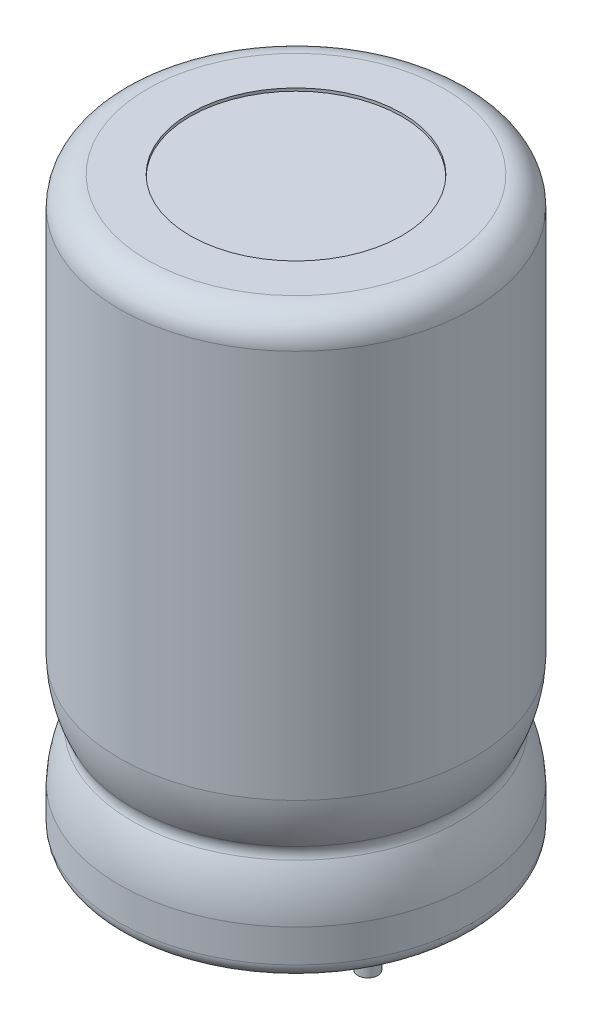
ISO-10303-21;
HEADER;
FILE_DESCRIPTION(('STEP AP214'),'2;1');
FILE_NAME('part.step','',(''),(''),'','','');
FILE_SCHEMA(('AUTOMOTIVE_DESIGN { 1 0 10303 214 1 1 1 1 }'));
ENDSEC;
DATA;
#1=APPLICATION_CONTEXT('core data for automotive mechanical design processes');
#2=APPLICATION_PROTOCOL_DEFINITION('international standard','automotive_design',2000,#1);
#3=PRODUCT_CONTEXT('',#1,'mechanical');
#4=PRODUCT('Part','Part','',(#3));
#5=PRODUCT_RELATED_PRODUCT_CATEGORY('part','',(#4));
#6=PRODUCT_DEFINITION_FORMATION('','',#4);
#7=PRODUCT_DEFINITION_CONTEXT('part definition',#1,'design');
#8=PRODUCT_DEFINITION('design','',#6,#7);
#9=PRODUCT_DEFINITION_SHAPE('','',#8);
#10=(LENGTH_UNIT() NAMED_UNIT(*) SI_UNIT(.MILLI.,.METRE.));
#11=(NAMED_UNIT(*) PLANE_ANGLE_UNIT() SI_UNIT($,.RADIAN.));
#12=(NAMED_UNIT(*) SI_UNIT($,.STERADIAN.) SOLID_ANGLE_UNIT());
#13=UNCERTAINTY_MEASURE_WITH_UNIT(LENGTH_MEASURE(1.E-05),#10,'distance_accuracy_value','');
#14=(GEOMETRIC_REPRESENTATION_CONTEXT(3) GLOBAL_UNCERTAINTY_ASSIGNED_CONTEXT((#13)) GLOBAL_UNIT_ASSIGNED_CONTEXT((#10,
#11,#12)) REPRESENTATION_CONTEXT('',''));
#15=CARTESIAN_POINT('',(0.,0.,0.));
#16=DIRECTION('',(0.,0.,1.));
#17=DIRECTION('',(1.,0.,0.));
#18=AXIS2_PLACEMENT_3D('',#15,#16,#17);
#19=CARTESIAN_POINT('',(-2.54,-0.2,0.));
#20=DIRECTION('',(0.,-1.,0.));
#21=DIRECTION('',(0.,0.,-1.));
#22=AXIS2_PLACEMENT_3D('',#19,#20,#21);
#23=PLANE('',#22);
#24=CARTESIAN_POINT('',(-2.54,-0.2,0.));
#25=DIRECTION('',(0.,-1.,0.));
#26=DIRECTION('',(0.,0.,-1.));
#27=AXIS2_PLACEMENT_3D('',#24,#25,#26);
#28=CIRCLE('',#27,5.75);
#29=CARTESIAN_POINT('',(-2.54,-0.2,-5.75));
#30=VERTEX_POINT('',#29);
#31=EDGE_CURVE('E83',#30,#30,#28,.T.);
#32=ORIENTED_EDGE('',*,*,#31,.T.);
#33=EDGE_LOOP('',(#32));
#34=FACE_BOUND('',#33,.T.);
#35=CARTESIAN_POINT('',(-2.54,-0.2,0.));
#36=DIRECTION('',(0.,-1.,0.));
#37=DIRECTION('',(0.,0.,-1.));
#38=AXIS2_PLACEMENT_3D('',#35,#36,#37);
#39=CIRCLE('',#38,3.75);
#40=CARTESIAN_POINT('',(-2.54,-0.2,-3.75));
#41=VERTEX_POINT('',#40);
#42=EDGE_CURVE('E71',#41,#41,#39,.T.);
#43=ORIENTED_EDGE('',*,*,#42,.F.);
#44=EDGE_LOOP('',(#43));
#45=FACE_BOUND('',#44,.T.);
#46=ADVANCED_FACE('F29',(#34,#45),#23,.T.);
#47=CARTESIAN_POINT('',(-2.54,-0.2,0.));
#48=DIRECTION('',(0.,1.,0.));
#49=DIRECTION('',(0.,0.,1.));
#50=AXIS2_PLACEMENT_3D('',#47,#48,#49);
#51=CYLINDRICAL_SURFACE('',#50,6.25);
#52=CARTESIAN_POINT('',(-2.54,1.45962740384602,0.));
#53=DIRECTION('',(0.,-1.,0.));
#54=DIRECTION('',(0.,0.,-1.));
#55=AXIS2_PLACEMENT_3D('',#52,#53,#54);
#56=CIRCLE('',#55,6.25);
#57=CARTESIAN_POINT('',(-2.54,1.45962740384602,-6.25));
#58=VERTEX_POINT('',#57);
#59=EDGE_CURVE('E45',#58,#58,#56,.T.);
#60=ORIENTED_EDGE('',*,*,#59,.T.);
#61=EDGE_LOOP('',(#60));
#62=FACE_BOUND('',#61,.T.);
#63=CARTESIAN_POINT('',(-2.54,0.3,0.));
#64=DIRECTION('',(0.,-1.,0.));
#65=DIRECTION('',(0.,0.,-1.));
#66=AXIS2_PLACEMENT_3D('',#63,#64,#65);
#67=CIRCLE('',#66,6.25);
#68=CARTESIAN_POINT('',(-2.54,0.3,-6.25));
#69=VERTEX_POINT('',#68);
#70=EDGE_CURVE('E42',#69,#69,#67,.F.);
#71=ORIENTED_EDGE('',*,*,#70,.T.);
#72=EDGE_LOOP('',(#71));
#73=FACE_BOUND('',#72,.T.);
#74=ADVANCED_FACE('F88',(#62,#73),#51,.T.);
#75=CARTESIAN_POINT('',(-2.54,-0.1,0.));
#76=DIRECTION('',(0.,-1.,0.));
#77=DIRECTION('',(0.,0.,-1.));
#78=AXIS2_PLACEMENT_3D('',#75,#76,#77);
#79=CYLINDRICAL_SURFACE('',#78,3.75);
#80=CARTESIAN_POINT('',(-2.54,-0.1,0.));
#81=DIRECTION('',(0.,-1.,0.));
#82=DIRECTION('',(0.,0.,-1.));
#83=AXIS2_PLACEMENT_3D('',#80,#81,#82);
#84=CIRCLE('',#83,3.75);
#85=CARTESIAN_POINT('',(-2.54,-0.1,-3.75));
#86=VERTEX_POINT('',#85);
#87=EDGE_CURVE('E72',#86,#86,#84,.T.);
#88=ORIENTED_EDGE('',*,*,#87,.F.);
#89=EDGE_LOOP('',(#88));
#90=FACE_BOUND('',#89,.T.);
#91=ORIENTED_EDGE('',*,*,#42,.T.);
#92=EDGE_LOOP('',(#91));
#93=FACE_BOUND('',#92,.T.);
#94=ADVANCED_FACE('F102',(#90,#93),#79,.F.);
#95=CARTESIAN_POINT('',(-2.54,-0.1,0.));
#96=DIRECTION('',(0.,-1.,0.));
#97=DIRECTION('',(0.,0.,-1.));
#98=AXIS2_PLACEMENT_3D('',#95,#96,#97);
#99=PLANE('',#98);
#100=CARTESIAN_POINT('',(0.,-0.1,0.));
#101=DIRECTION('',(0.,-1.,0.));
#102=DIRECTION('',(0.,0.,-1.));
#103=AXIS2_PLACEMENT_3D('',#100,#101,#102);
#104=CIRCLE('',#103,0.35);
#105=CARTESIAN_POINT('',(0.,-0.1,-0.35));
#106=VERTEX_POINT('',#105);
#107=EDGE_CURVE('E63',#106,#106,#104,.T.);
#108=ORIENTED_EDGE('',*,*,#107,.F.);
#109=EDGE_LOOP('',(#108));
#110=FACE_BOUND('',#109,.T.);
#111=CARTESIAN_POINT('',(-5.08,-0.1,0.));
#112=DIRECTION('',(0.,-1.,0.));
#113=DIRECTION('',(0.,0.,-1.));
#114=AXIS2_PLACEMENT_3D('',#111,#112,#113);
#115=CIRCLE('',#114,0.35);
#116=CARTESIAN_POINT('',(-5.08,-0.1,-0.35));
#117=VERTEX_POINT('',#116);
#118=EDGE_CURVE('E68',#117,#117,#115,.T.);
#119=ORIENTED_EDGE('',*,*,#118,.F.);
#120=EDGE_LOOP('',(#119));
#121=FACE_BOUND('',#120,.T.);
#122=ORIENTED_EDGE('',*,*,#87,.T.);
#123=EDGE_LOOP('',(#122));
#124=FACE_BOUND('',#123,.T.);
#125=ADVANCED_FACE('F104',(#110,#121,#124),#99,.T.);
#126=CARTESIAN_POINT('',(-5.08,-3.,0.));
#127=DIRECTION('',(0.,-1.,0.));
#128=DIRECTION('',(0.,0.,-1.));
#129=AXIS2_PLACEMENT_3D('',#126,#127,#128);
#130=PLANE('',#129);
#131=CARTESIAN_POINT('',(-5.08,-3.,0.));
#132=DIRECTION('',(0.,-1.,0.));
#133=DIRECTION('',(0.,0.,-1.));
#134=AXIS2_PLACEMENT_3D('',#131,#132,#133);
#135=CIRCLE('',#134,0.35);
#136=CARTESIAN_POINT('',(-5.08,-3.,-0.35));
#137=VERTEX_POINT('',#136);
#138=EDGE_CURVE('E75',#137,#137,#135,.T.);
#139=ORIENTED_EDGE('',*,*,#138,.T.);
#140=EDGE_LOOP('',(#139));
#141=FACE_BOUND('',#140,.T.);
#142=ADVANCED_FACE('F111',(#141),#130,.T.);
#143=CARTESIAN_POINT('',(-5.08,-3.,0.));
#144=DIRECTION('',(0.,1.,0.));
#145=DIRECTION('',(0.,0.,1.));
#146=AXIS2_PLACEMENT_3D('',#143,#144,#145);
#147=CYLINDRICAL_SURFACE('',#146,0.35);
#148=ORIENTED_EDGE('',*,*,#138,.F.);
#149=EDGE_LOOP('',(#148));
#150=FACE_BOUND('',#149,.T.);
#151=ORIENTED_EDGE('',*,*,#118,.T.);
#152=EDGE_LOOP('',(#151));
#153=FACE_BOUND('',#152,.T.);
#154=ADVANCED_FACE('F126',(#150,#153),#147,.T.);
#155=CARTESIAN_POINT('',(0.,-3.,0.));
#156=DIRECTION('',(0.,1.,0.));
#157=DIRECTION('',(0.,0.,1.));
#158=AXIS2_PLACEMENT_3D('',#155,#156,#157);
#159=PLANE('',#158);
#160=CARTESIAN_POINT('',(0.,-3.,0.));
#161=DIRECTION('',(0.,1.,0.));
#162=DIRECTION('',(0.,0.,1.));
#163=AXIS2_PLACEMENT_3D('',#160,#161,#162);
#164=CIRCLE('',#163,0.35);
#165=CARTESIAN_POINT('',(0.,-3.,0.35));
#166=VERTEX_POINT('',#165);
#167=EDGE_CURVE('E80',#166,#166,#164,.T.);
#168=ORIENTED_EDGE('',*,*,#167,.F.);
#169=EDGE_LOOP('',(#168));
#170=FACE_BOUND('',#169,.T.);
#171=ADVANCED_FACE('F130',(#170),#159,.F.);
#172=CARTESIAN_POINT('',(0.,-3.,0.));
#173=DIRECTION('',(0.,1.,0.));
#174=DIRECTION('',(0.,0.,1.));
#175=AXIS2_PLACEMENT_3D('',#172,#173,#174);
#176=CYLINDRICAL_SURFACE('',#175,0.35);
#177=ORIENTED_EDGE('',*,*,#167,.T.);
#178=EDGE_LOOP('',(#177));
#179=FACE_BOUND('',#178,.T.);
#180=ORIENTED_EDGE('',*,*,#107,.T.);
#181=EDGE_LOOP('',(#180));
#182=FACE_BOUND('',#181,.T.);
#183=ADVANCED_FACE('F94',(#179,#182),#176,.T.);
#184=CARTESIAN_POINT('',(-2.54,0.3,0.));
#185=DIRECTION('',(0.,-1.,0.));
#186=DIRECTION('',(0.,0.,-1.));
#187=AXIS2_PLACEMENT_3D('',#184,#185,#186);
#188=TOROIDAL_SURFACE('',#187,5.75,0.5);
#189=ORIENTED_EDGE('',*,*,#70,.F.);
#190=EDGE_LOOP('',(#189));
#191=FACE_BOUND('',#190,.T.);
#192=ORIENTED_EDGE('',*,*,#31,.F.);
#193=EDGE_LOOP('',(#192));
#194=FACE_BOUND('',#193,.T.);
#195=ADVANCED_FACE('F90',(#191,#194),#188,.T.);
#196=CARTESIAN_POINT('',(-2.54,5.51518629807699,0.));
#197=DIRECTION('',(0.,-1.,0.));
#198=DIRECTION('',(0.,0.,-1.));
#199=AXIS2_PLACEMENT_3D('',#196,#197,#198);
#200=DEGENERATE_TOROIDAL_SURFACE('',#199,2.02591666666635,4.22769911859006,.T.);
#201=CARTESIAN_POINT('',(-2.54,3.61,0.));
#202=DIRECTION('',(0.,-1.,0.));
#203=DIRECTION('',(0.,0.,-1.));
#204=AXIS2_PLACEMENT_3D('',#201,#202,#203);
#205=CIRCLE('',#204,5.8);
#206=CARTESIAN_POINT('',(-2.54,3.61,-5.8));
#207=VERTEX_POINT('',#206);
#208=EDGE_CURVE('E53',#207,#207,#205,.T.);
#209=ORIENTED_EDGE('',*,*,#208,.F.);
#210=EDGE_LOOP('',(#209));
#211=FACE_BOUND('',#210,.T.);
#212=CARTESIAN_POINT('',(-2.54,5.34037259615399,0.));
#213=DIRECTION('',(0.,1.,0.));
#214=DIRECTION('',(0.,0.,1.));
#215=AXIS2_PLACEMENT_3D('',#212,#213,#214);
#216=CIRCLE('',#215,6.25);
#217=CARTESIAN_POINT('',(-2.54,5.34037259615399,6.25));
#218=VERTEX_POINT('',#217);
#219=EDGE_CURVE('E33',#218,#218,#216,.T.);
#220=ORIENTED_EDGE('',*,*,#219,.F.);
#221=EDGE_LOOP('',(#220));
#222=FACE_BOUND('',#221,.T.);
#223=ADVANCED_FACE('F93',(#211,#222),#200,.T.);
#224=CARTESIAN_POINT('',(-2.54,1.28481370192301,0.));
#225=DIRECTION('',(0.,-1.,0.));
#226=DIRECTION('',(0.,0.,-1.));
#227=AXIS2_PLACEMENT_3D('',#224,#225,#226);
#228=DEGENERATE_TOROIDAL_SURFACE('',#227,2.02591666666638,4.22769911859003,.T.);
#229=CARTESIAN_POINT('',(-2.54,3.19,0.));
#230=DIRECTION('',(0.,-1.,0.));
#231=DIRECTION('',(0.,0.,-1.));
#232=AXIS2_PLACEMENT_3D('',#229,#230,#231);
#233=CIRCLE('',#232,5.8);
#234=CARTESIAN_POINT('',(-2.54,3.19,-5.8));
#235=VERTEX_POINT('',#234);
#236=EDGE_CURVE('E47',#235,#235,#233,.T.);
#237=ORIENTED_EDGE('',*,*,#236,.T.);
#238=EDGE_LOOP('',(#237));
#239=FACE_BOUND('',#238,.T.);
#240=ORIENTED_EDGE('',*,*,#59,.F.);
#241=EDGE_LOOP('',(#240));
#242=FACE_BOUND('',#241,.T.);
#243=ADVANCED_FACE('F161',(#239,#242),#228,.T.);
#244=CARTESIAN_POINT('',(-2.54,3.4,0.));
#245=DIRECTION('',(0.,-1.,0.));
#246=DIRECTION('',(0.,0.,-1.));
#247=AXIS2_PLACEMENT_3D('',#244,#245,#246);
#248=TOROIDAL_SURFACE('',#247,6.21600000000002,0.466000000000018);
#249=ORIENTED_EDGE('',*,*,#236,.F.);
#250=EDGE_LOOP('',(#249));
#251=FACE_BOUND('',#250,.T.);
#252=ORIENTED_EDGE('',*,*,#208,.T.);
#253=EDGE_LOOP('',(#252));
#254=FACE_BOUND('',#253,.T.);
#255=ADVANCED_FACE('F170',(#251,#254),#248,.F.);
#256=CARTESIAN_POINT('',(-2.54,20.,0.));
#257=DIRECTION('',(0.,1.,0.));
#258=DIRECTION('',(0.,0.,1.));
#259=AXIS2_PLACEMENT_3D('',#256,#257,#258);
#260=PLANE('',#259);
#261=CARTESIAN_POINT('',(-2.54,20.,0.));
#262=DIRECTION('',(0.,1.,0.));
#263=DIRECTION('',(0.,0.,1.));
#264=AXIS2_PLACEMENT_3D('',#261,#262,#263);
#265=CIRCLE('',#264,3.75);
#266=CARTESIAN_POINT('',(-2.54,20.,3.75));
#267=VERTEX_POINT('',#266);
#268=EDGE_CURVE('E60',#267,#267,#265,.T.);
#269=ORIENTED_EDGE('',*,*,#268,.T.);
#270=EDGE_LOOP('',(#269));
#271=FACE_BOUND('',#270,.T.);
#272=ADVANCED_FACE('F177',(#271),#260,.T.);
#273=CARTESIAN_POINT('',(-2.54,20.,0.));
#274=DIRECTION('',(0.,1.,0.));
#275=DIRECTION('',(0.,0.,1.));
#276=AXIS2_PLACEMENT_3D('',#273,#274,#275);
#277=CYLINDRICAL_SURFACE('',#276,3.75);
#278=ORIENTED_EDGE('',*,*,#268,.F.);
#279=EDGE_LOOP('',(#278));
#280=FACE_BOUND('',#279,.T.);
#281=CARTESIAN_POINT('',(-2.54,20.1,0.));
#282=DIRECTION('',(0.,1.,0.));
#283=DIRECTION('',(0.,0.,1.));
#284=AXIS2_PLACEMENT_3D('',#281,#282,#283);
#285=CIRCLE('',#284,3.75);
#286=CARTESIAN_POINT('',(-2.54,20.1,3.75));
#287=VERTEX_POINT('',#286);
#288=EDGE_CURVE('E51',#287,#287,#285,.T.);
#289=ORIENTED_EDGE('',*,*,#288,.T.);
#290=EDGE_LOOP('',(#289));
#291=FACE_BOUND('',#290,.T.);
#292=ADVANCED_FACE('F121',(#280,#291),#277,.F.);
#293=CARTESIAN_POINT('',(-2.54,20.1,0.));
#294=DIRECTION('',(0.,-1.,0.));
#295=DIRECTION('',(0.,0.,-1.));
#296=AXIS2_PLACEMENT_3D('',#293,#294,#295);
#297=PLANE('',#296);
#298=ORIENTED_EDGE('',*,*,#288,.F.);
#299=EDGE_LOOP('',(#298));
#300=FACE_BOUND('',#299,.T.);
#301=CARTESIAN_POINT('',(-2.54,20.1,0.));
#302=DIRECTION('',(0.,-1.,0.));
#303=DIRECTION('',(0.,0.,-1.));
#304=AXIS2_PLACEMENT_3D('',#301,#302,#303);
#305=CIRCLE('',#304,5.25);
#306=CARTESIAN_POINT('',(-2.54,20.1,-5.25));
#307=VERTEX_POINT('',#306);
#308=EDGE_CURVE('E10',#307,#307,#305,.F.);
#309=ORIENTED_EDGE('',*,*,#308,.T.);
#310=EDGE_LOOP('',(#309));
#311=FACE_BOUND('',#310,.T.);
#312=ADVANCED_FACE('F119',(#300,#311),#297,.F.);
#313=CARTESIAN_POINT('',(-2.54,19.1,0.));
#314=DIRECTION('',(0.,-1.,0.));
#315=DIRECTION('',(0.,0.,-1.));
#316=AXIS2_PLACEMENT_3D('',#313,#314,#315);
#317=TOROIDAL_SURFACE('',#316,5.25,1.);
#318=ORIENTED_EDGE('',*,*,#308,.F.);
#319=EDGE_LOOP('',(#318));
#320=FACE_BOUND('',#319,.T.);
#321=CARTESIAN_POINT('',(-2.54,19.1,0.));
#322=DIRECTION('',(0.,-1.,0.));
#323=DIRECTION('',(0.,0.,-1.));
#324=AXIS2_PLACEMENT_3D('',#321,#322,#323);
#325=CIRCLE('',#324,6.25);
#326=CARTESIAN_POINT('',(-2.54,19.1,-6.25));
#327=VERTEX_POINT('',#326);
#328=EDGE_CURVE('E37',#327,#327,#325,.T.);
#329=ORIENTED_EDGE('',*,*,#328,.F.);
#330=EDGE_LOOP('',(#329));
#331=FACE_BOUND('',#330,.T.);
#332=ADVANCED_FACE('F31',(#320,#331),#317,.T.);
#333=ORIENTED_EDGE('',*,*,#328,.T.);
#334=EDGE_LOOP('',(#333));
#335=FACE_BOUND('',#334,.T.);
#336=ORIENTED_EDGE('',*,*,#219,.T.);
#337=EDGE_LOOP('',(#336));
#338=FACE_BOUND('',#337,.T.);
#339=ADVANCED_FACE('F115',(#335,#338),#51,.T.);
#340=CLOSED_SHELL('',(#46,#74,#94,#125,#142,#154,#171,#183,#195,#223,#243,#255,#272,#292,#312,
#332,#339));
#341=MANIFOLD_SOLID_BREP('B2',#340);
#342=ADVANCED_BREP_SHAPE_REPRESENTATION('',(#18,#341),#14);
#343=SHAPE_DEFINITION_REPRESENTATION(#9,#342);
ENDSEC;
END-ISO-10303-21;
